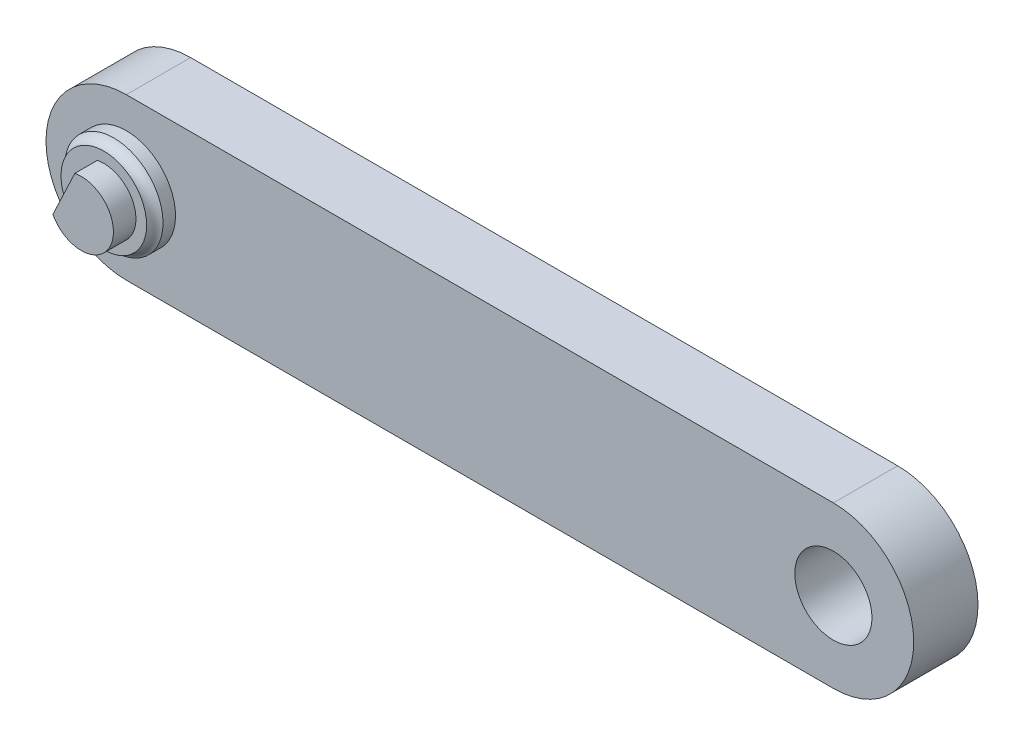
ISO-10303-21;
HEADER;
FILE_DESCRIPTION(('STEP AP214'),'2;1');
FILE_NAME('part.step','',(''),(''),'','','');
FILE_SCHEMA(('AUTOMOTIVE_DESIGN { 1 0 10303 214 1 1 1 1 }'));
ENDSEC;
DATA;
#1=APPLICATION_CONTEXT('core data for automotive mechanical design processes');
#2=APPLICATION_PROTOCOL_DEFINITION('international standard','automotive_design',2000,#1);
#3=PRODUCT_CONTEXT('',#1,'mechanical');
#4=PRODUCT('Part','Part','',(#3));
#5=PRODUCT_RELATED_PRODUCT_CATEGORY('part','',(#4));
#6=PRODUCT_DEFINITION_FORMATION('','',#4);
#7=PRODUCT_DEFINITION_CONTEXT('part definition',#1,'design');
#8=PRODUCT_DEFINITION('design','',#6,#7);
#9=PRODUCT_DEFINITION_SHAPE('','',#8);
#10=(LENGTH_UNIT() NAMED_UNIT(*) SI_UNIT(.MILLI.,.METRE.));
#11=(NAMED_UNIT(*) PLANE_ANGLE_UNIT() SI_UNIT($,.RADIAN.));
#12=(NAMED_UNIT(*) SI_UNIT($,.STERADIAN.) SOLID_ANGLE_UNIT());
#13=UNCERTAINTY_MEASURE_WITH_UNIT(LENGTH_MEASURE(1.E-05),#10,'distance_accuracy_value','');
#14=(GEOMETRIC_REPRESENTATION_CONTEXT(3) GLOBAL_UNCERTAINTY_ASSIGNED_CONTEXT((#13)) GLOBAL_UNIT_ASSIGNED_CONTEXT((#10,
#11,#12)) REPRESENTATION_CONTEXT('',''));
#15=CARTESIAN_POINT('',(0.,0.,0.));
#16=DIRECTION('',(0.,0.,1.));
#17=DIRECTION('',(1.,0.,0.));
#18=AXIS2_PLACEMENT_3D('',#15,#16,#17);
#19=CARTESIAN_POINT('',(-18.7976088830021,-15.2994505494506,0.0107761984166474));
#20=DIRECTION('',(0.,0.,-1.));
#21=DIRECTION('',(-1.,0.,0.));
#22=AXIS2_PLACEMENT_3D('',#19,#20,#21);
#23=PLANE('',#22);
#24=CARTESIAN_POINT('',(0.,0.,0.0107761984166474));
#25=DIRECTION('',(0.,0.,1.));
#26=DIRECTION('',(1.,0.,0.));
#27=AXIS2_PLACEMENT_3D('',#24,#25,#26);
#28=CIRCLE('',#27,13.3173639972004);
#29=CARTESIAN_POINT('',(13.3173639972004,0.,0.0107761984166474));
#30=VERTEX_POINT('',#29);
#31=EDGE_CURVE('E43',#30,#30,#28,.F.);
#32=ORIENTED_EDGE('',*,*,#31,.F.);
#33=EDGE_LOOP('',(#32));
#34=FACE_BOUND('',#33,.T.);
#35=CARTESIAN_POINT('',(0.,0.,0.0107761984166474));
#36=DIRECTION('',(0.,0.,1.));
#37=DIRECTION('',(1.,0.,0.));
#38=AXIS2_PLACEMENT_3D('',#35,#36,#37);
#39=CIRCLE('',#38,10.);
#40=CARTESIAN_POINT('',(-8.83901648481329,-4.67672829884301,0.0107761984166474));
#41=VERTEX_POINT('',#40);
#42=CARTESIAN_POINT('',(-2.01473455114157,9.7949397490968,0.0107761984166474));
#43=VERTEX_POINT('',#42);
#44=EDGE_CURVE('E64',#41,#43,#39,.T.);
#45=ORIENTED_EDGE('',*,*,#44,.F.);
#46=DIRECTION('',(-0.426517620854483,-0.904479252996238,0.));
#47=VECTOR('',#46,1.);
#48=CARTESIAN_POINT('',(-2.01473455114157,9.7949397490968,0.0107761984166474));
#49=LINE('',#48,#47);
#50=EDGE_CURVE('E49',#43,#41,#49,.T.);
#51=ORIENTED_EDGE('',*,*,#50,.F.);
#52=EDGE_LOOP('',(#45,#51));
#53=FACE_BOUND('',#52,.T.);
#54=ADVANCED_FACE('F35',(#34,#53),#23,.F.);
#55=CARTESIAN_POINT('',(0.,0.,0.));
#56=DIRECTION('',(0.,0.,1.));
#57=DIRECTION('',(1.,0.,0.));
#58=AXIS2_PLACEMENT_3D('',#55,#56,#57);
#59=TOROIDAL_SURFACE('',#58,16.75,3.43265291781274);
#60=ORIENTED_EDGE('',*,*,#31,.T.);
#61=EDGE_LOOP('',(#60));
#62=FACE_BOUND('',#61,.T.);
#63=CARTESIAN_POINT('',(0.,0.,-3.11111111111112));
#64=DIRECTION('',(0.,0.,1.));
#65=DIRECTION('',(1.,0.,0.));
#66=AXIS2_PLACEMENT_3D('',#63,#64,#65);
#67=CIRCLE('',#66,15.2994505494505);
#68=CARTESIAN_POINT('',(15.2994505494505,0.,-3.11111111111112));
#69=VERTEX_POINT('',#68);
#70=EDGE_CURVE('E11',#69,#69,#67,.T.);
#71=ORIENTED_EDGE('',*,*,#70,.T.);
#72=EDGE_LOOP('',(#71));
#73=FACE_BOUND('',#72,.T.);
#74=ADVANCED_FACE('F37',(#62,#73),#59,.F.);
#75=CARTESIAN_POINT('',(0.,0.,7.));
#76=DIRECTION('',(0.,0.,1.));
#77=DIRECTION('',(1.,0.,0.));
#78=AXIS2_PLACEMENT_3D('',#75,#76,#77);
#79=CYLINDRICAL_SURFACE('',#78,15.2994505494506);
#80=ORIENTED_EDGE('',*,*,#70,.F.);
#81=EDGE_LOOP('',(#80));
#82=FACE_BOUND('',#81,.T.);
#83=CARTESIAN_POINT('',(0.,0.,-7.));
#84=DIRECTION('',(0.,0.,1.));
#85=DIRECTION('',(1.,0.,0.));
#86=AXIS2_PLACEMENT_3D('',#83,#84,#85);
#87=CIRCLE('',#86,15.2994505494506);
#88=CARTESIAN_POINT('',(15.2994505494506,0.,-7.));
#89=VERTEX_POINT('',#88);
#90=EDGE_CURVE('E122',#89,#89,#87,.T.);
#91=ORIENTED_EDGE('',*,*,#90,.T.);
#92=EDGE_LOOP('',(#91));
#93=FACE_BOUND('',#92,.T.);
#94=ADVANCED_FACE('F150',(#82,#93),#79,.T.);
#95=CARTESIAN_POINT('',(0.,0.,7.02155239841665));
#96=DIRECTION('',(0.,0.,-1.));
#97=DIRECTION('',(-1.,0.,0.));
#98=AXIS2_PLACEMENT_3D('',#95,#96,#97);
#99=CYLINDRICAL_SURFACE('',#98,10.);
#100=ORIENTED_EDGE('',*,*,#44,.T.);
#101=DIRECTION('',(0.,0.,-1.));
#102=VECTOR('',#101,1.);
#103=CARTESIAN_POINT('',(-2.01473455114157,9.7949397490968,7.02155239841665));
#104=LINE('',#103,#102);
#105=CARTESIAN_POINT('',(-2.01473455114157,9.7949397490968,7.02155239841665));
#106=VERTEX_POINT('',#105);
#107=EDGE_CURVE('E139',#106,#43,#104,.T.);
#108=ORIENTED_EDGE('',*,*,#107,.F.);
#109=CARTESIAN_POINT('',(0.,0.,7.02155239841665));
#110=DIRECTION('',(0.,0.,1.));
#111=DIRECTION('',(1.,0.,0.));
#112=AXIS2_PLACEMENT_3D('',#109,#110,#111);
#113=CIRCLE('',#112,10.);
#114=CARTESIAN_POINT('',(-8.83901648481329,-4.67672829884301,7.02155239841665));
#115=VERTEX_POINT('',#114);
#116=EDGE_CURVE('E131',#115,#106,#113,.T.);
#117=ORIENTED_EDGE('',*,*,#116,.F.);
#118=DIRECTION('',(0.,0.,-1.));
#119=VECTOR('',#118,1.);
#120=CARTESIAN_POINT('',(-8.83901648481329,-4.67672829884301,7.02155239841665));
#121=LINE('',#120,#119);
#122=EDGE_CURVE('E134',#115,#41,#121,.T.);
#123=ORIENTED_EDGE('',*,*,#122,.T.);
#124=EDGE_LOOP('',(#100,#108,#117,#123));
#125=FACE_BOUND('',#124,.T.);
#126=ADVANCED_FACE('F152',(#125),#99,.T.);
#127=CARTESIAN_POINT('',(-2.01473455114157,9.7949397490968,7.02155239841665));
#128=DIRECTION('',(0.904479252996238,-0.426517620854483,0.));
#129=DIRECTION('',(0.426517620854483,0.904479252996238,0.));
#130=AXIS2_PLACEMENT_3D('',#127,#128,#129);
#131=PLANE('',#130);
#132=ORIENTED_EDGE('',*,*,#50,.T.);
#133=ORIENTED_EDGE('',*,*,#122,.F.);
#134=DIRECTION('',(-0.426517620854483,-0.904479252996238,0.));
#135=VECTOR('',#134,1.);
#136=CARTESIAN_POINT('',(-2.01473455114157,9.7949397490968,7.02155239841665));
#137=LINE('',#136,#135);
#138=EDGE_CURVE('E57',#106,#115,#137,.T.);
#139=ORIENTED_EDGE('',*,*,#138,.F.);
#140=ORIENTED_EDGE('',*,*,#107,.T.);
#141=EDGE_LOOP('',(#132,#133,#139,#140));
#142=FACE_BOUND('',#141,.T.);
#143=ADVANCED_FACE('F159',(#142),#131,.F.);
#144=CARTESIAN_POINT('',(0.,0.,7.02155239841665));
#145=DIRECTION('',(0.,0.,1.));
#146=DIRECTION('',(1.,0.,0.));
#147=AXIS2_PLACEMENT_3D('',#144,#145,#146);
#148=PLANE('',#147);
#149=ORIENTED_EDGE('',*,*,#116,.T.);
#150=ORIENTED_EDGE('',*,*,#138,.T.);
#151=EDGE_LOOP('',(#149,#150));
#152=FACE_BOUND('',#151,.T.);
#153=ADVANCED_FACE('F167',(#152),#148,.T.);
#154=CARTESIAN_POINT('',(0.,0.,-7.));
#155=DIRECTION('',(0.,0.,1.));
#156=DIRECTION('',(1.,0.,0.));
#157=AXIS2_PLACEMENT_3D('',#154,#155,#156);
#158=PLANE('',#157);
#159=CARTESIAN_POINT('',(220.,0.,-7.));
#160=DIRECTION('',(0.,0.,1.));
#161=DIRECTION('',(1.,0.,0.));
#162=AXIS2_PLACEMENT_3D('',#159,#160,#161);
#163=CIRCLE('',#162,12.);
#164=CARTESIAN_POINT('',(232.,0.,-7.));
#165=VERTEX_POINT('',#164);
#166=EDGE_CURVE('E119',#165,#165,#163,.T.);
#167=ORIENTED_EDGE('',*,*,#166,.F.);
#168=EDGE_LOOP('',(#167));
#169=FACE_BOUND('',#168,.T.);
#170=CARTESIAN_POINT('',(0.,0.,-7.));
#171=DIRECTION('',(0.,0.,1.));
#172=DIRECTION('',(1.,0.,0.));
#173=AXIS2_PLACEMENT_3D('',#170,#171,#172);
#174=CIRCLE('',#173,25.);
#175=CARTESIAN_POINT('',(0.,25.,-7.));
#176=VERTEX_POINT('',#175);
#177=CARTESIAN_POINT('',(0.,-25.,-7.));
#178=VERTEX_POINT('',#177);
#179=EDGE_CURVE('E265',#176,#178,#174,.T.);
#180=ORIENTED_EDGE('',*,*,#179,.T.);
#181=DIRECTION('',(1.,0.,0.));
#182=VECTOR('',#181,1.);
#183=CARTESIAN_POINT('',(0.,-25.,-7.));
#184=LINE('',#183,#182);
#185=CARTESIAN_POINT('',(220.,-25.,-7.));
#186=VERTEX_POINT('',#185);
#187=EDGE_CURVE('E96',#178,#186,#184,.T.);
#188=ORIENTED_EDGE('',*,*,#187,.T.);
#189=CARTESIAN_POINT('',(220.,0.,-7.));
#190=DIRECTION('',(0.,0.,1.));
#191=DIRECTION('',(1.,0.,0.));
#192=AXIS2_PLACEMENT_3D('',#189,#190,#191);
#193=CIRCLE('',#192,25.);
#194=CARTESIAN_POINT('',(220.,25.,-7.));
#195=VERTEX_POINT('',#194);
#196=EDGE_CURVE('E269',#186,#195,#193,.T.);
#197=ORIENTED_EDGE('',*,*,#196,.T.);
#198=DIRECTION('',(-1.,0.,0.));
#199=VECTOR('',#198,1.);
#200=CARTESIAN_POINT('',(0.,25.,-7.));
#201=LINE('',#200,#199);
#202=EDGE_CURVE('E72',#195,#176,#201,.T.);
#203=ORIENTED_EDGE('',*,*,#202,.T.);
#204=EDGE_LOOP('',(#180,#188,#197,#203));
#205=FACE_BOUND('',#204,.T.);
#206=ORIENTED_EDGE('',*,*,#90,.F.);
#207=EDGE_LOOP('',(#206));
#208=FACE_BOUND('',#207,.T.);
#209=ADVANCED_FACE('F165',(#169,#205,#208),#158,.T.);
#210=CARTESIAN_POINT('',(0.,0.,-7.));
#211=DIRECTION('',(0.,0.,-1.));
#212=DIRECTION('',(-1.,0.,0.));
#213=AXIS2_PLACEMENT_3D('',#210,#211,#212);
#214=CYLINDRICAL_SURFACE('',#213,25.);
#215=DIRECTION('',(0.,0.,-1.));
#216=VECTOR('',#215,1.);
#217=CARTESIAN_POINT('',(0.,25.,-7.));
#218=LINE('',#217,#216);
#219=CARTESIAN_POINT('',(0.,25.,-27.));
#220=VERTEX_POINT('',#219);
#221=EDGE_CURVE('E110',#176,#220,#218,.T.);
#222=ORIENTED_EDGE('',*,*,#221,.T.);
#223=CARTESIAN_POINT('',(0.,0.,-27.));
#224=DIRECTION('',(0.,0.,1.));
#225=DIRECTION('',(1.,0.,0.));
#226=AXIS2_PLACEMENT_3D('',#223,#224,#225);
#227=CIRCLE('',#226,25.);
#228=CARTESIAN_POINT('',(0.,-25.,-27.));
#229=VERTEX_POINT('',#228);
#230=EDGE_CURVE('E105',#229,#220,#227,.F.);
#231=ORIENTED_EDGE('',*,*,#230,.F.);
#232=DIRECTION('',(0.,0.,-1.));
#233=VECTOR('',#232,1.);
#234=CARTESIAN_POINT('',(0.,-25.,-7.));
#235=LINE('',#234,#233);
#236=EDGE_CURVE('E109',#178,#229,#235,.T.);
#237=ORIENTED_EDGE('',*,*,#236,.F.);
#238=ORIENTED_EDGE('',*,*,#179,.F.);
#239=EDGE_LOOP('',(#222,#231,#237,#238));
#240=FACE_BOUND('',#239,.T.);
#241=ADVANCED_FACE('F107',(#240),#214,.T.);
#242=CARTESIAN_POINT('',(0.,-25.,-7.));
#243=DIRECTION('',(0.,1.,0.));
#244=DIRECTION('',(0.,0.,1.));
#245=AXIS2_PLACEMENT_3D('',#242,#243,#244);
#246=PLANE('',#245);
#247=DIRECTION('',(1.,0.,0.));
#248=VECTOR('',#247,1.);
#249=CARTESIAN_POINT('',(0.,-25.,-27.));
#250=LINE('',#249,#248);
#251=CARTESIAN_POINT('',(220.,-25.,-27.));
#252=VERTEX_POINT('',#251);
#253=EDGE_CURVE('E116',#229,#252,#250,.T.);
#254=ORIENTED_EDGE('',*,*,#253,.T.);
#255=DIRECTION('',(0.,0.,-1.));
#256=VECTOR('',#255,1.);
#257=CARTESIAN_POINT('',(220.,-25.,-7.));
#258=LINE('',#257,#256);
#259=EDGE_CURVE('E123',#186,#252,#258,.T.);
#260=ORIENTED_EDGE('',*,*,#259,.F.);
#261=ORIENTED_EDGE('',*,*,#187,.F.);
#262=ORIENTED_EDGE('',*,*,#236,.T.);
#263=EDGE_LOOP('',(#254,#260,#261,#262));
#264=FACE_BOUND('',#263,.T.);
#265=ADVANCED_FACE('F121',(#264),#246,.F.);
#266=CARTESIAN_POINT('',(220.,0.,-7.));
#267=DIRECTION('',(0.,0.,-1.));
#268=DIRECTION('',(-1.,0.,0.));
#269=AXIS2_PLACEMENT_3D('',#266,#267,#268);
#270=CYLINDRICAL_SURFACE('',#269,25.);
#271=CARTESIAN_POINT('',(220.,0.,-27.));
#272=DIRECTION('',(0.,0.,1.));
#273=DIRECTION('',(1.,0.,0.));
#274=AXIS2_PLACEMENT_3D('',#271,#272,#273);
#275=CIRCLE('',#274,25.);
#276=CARTESIAN_POINT('',(220.,25.,-27.));
#277=VERTEX_POINT('',#276);
#278=EDGE_CURVE('E88',#252,#277,#275,.T.);
#279=ORIENTED_EDGE('',*,*,#278,.T.);
#280=DIRECTION('',(0.,0.,-1.));
#281=VECTOR('',#280,1.);
#282=CARTESIAN_POINT('',(220.,25.,-7.));
#283=LINE('',#282,#281);
#284=EDGE_CURVE('E127',#195,#277,#283,.T.);
#285=ORIENTED_EDGE('',*,*,#284,.F.);
#286=ORIENTED_EDGE('',*,*,#196,.F.);
#287=ORIENTED_EDGE('',*,*,#259,.T.);
#288=EDGE_LOOP('',(#279,#285,#286,#287));
#289=FACE_BOUND('',#288,.T.);
#290=ADVANCED_FACE('F183',(#289),#270,.T.);
#291=CARTESIAN_POINT('',(0.,25.,-7.));
#292=DIRECTION('',(0.,-1.,0.));
#293=DIRECTION('',(0.,0.,-1.));
#294=AXIS2_PLACEMENT_3D('',#291,#292,#293);
#295=PLANE('',#294);
#296=DIRECTION('',(-1.,0.,0.));
#297=VECTOR('',#296,1.);
#298=CARTESIAN_POINT('',(0.,25.,-27.));
#299=LINE('',#298,#297);
#300=EDGE_CURVE('E267',#277,#220,#299,.T.);
#301=ORIENTED_EDGE('',*,*,#300,.T.);
#302=ORIENTED_EDGE('',*,*,#221,.F.);
#303=ORIENTED_EDGE('',*,*,#202,.F.);
#304=ORIENTED_EDGE('',*,*,#284,.T.);
#305=EDGE_LOOP('',(#301,#302,#303,#304));
#306=FACE_BOUND('',#305,.T.);
#307=ADVANCED_FACE('F180',(#306),#295,.F.);
#308=CARTESIAN_POINT('',(220.,0.,-7.));
#309=DIRECTION('',(0.,0.,-1.));
#310=DIRECTION('',(-1.,0.,0.));
#311=AXIS2_PLACEMENT_3D('',#308,#309,#310);
#312=CYLINDRICAL_SURFACE('',#311,12.);
#313=ORIENTED_EDGE('',*,*,#166,.T.);
#314=EDGE_LOOP('',(#313));
#315=FACE_BOUND('',#314,.T.);
#316=CARTESIAN_POINT('',(220.,0.,-27.));
#317=DIRECTION('',(0.,0.,1.));
#318=DIRECTION('',(1.,0.,0.));
#319=AXIS2_PLACEMENT_3D('',#316,#317,#318);
#320=CIRCLE('',#319,12.);
#321=CARTESIAN_POINT('',(232.,0.,-27.));
#322=VERTEX_POINT('',#321);
#323=EDGE_CURVE('E114',#322,#322,#320,.T.);
#324=ORIENTED_EDGE('',*,*,#323,.F.);
#325=EDGE_LOOP('',(#324));
#326=FACE_BOUND('',#325,.T.);
#327=ADVANCED_FACE('F179',(#315,#326),#312,.F.);
#328=CARTESIAN_POINT('',(0.,0.,-27.));
#329=DIRECTION('',(0.,0.,-1.));
#330=DIRECTION('',(-1.,0.,0.));
#331=AXIS2_PLACEMENT_3D('',#328,#329,#330);
#332=PLANE('',#331);
#333=ORIENTED_EDGE('',*,*,#253,.F.);
#334=ORIENTED_EDGE('',*,*,#230,.T.);
#335=ORIENTED_EDGE('',*,*,#300,.F.);
#336=ORIENTED_EDGE('',*,*,#278,.F.);
#337=EDGE_LOOP('',(#333,#334,#335,#336));
#338=FACE_BOUND('',#337,.T.);
#339=ORIENTED_EDGE('',*,*,#323,.T.);
#340=EDGE_LOOP('',(#339));
#341=FACE_BOUND('',#340,.T.);
#342=ADVANCED_FACE('F117',(#338,#341),#332,.T.);
#343=CLOSED_SHELL('',(#54,#74,#94,#126,#143,#153,#209,#241,#265,#290,#307,#327,#342));
#344=MANIFOLD_SOLID_BREP('B2',#343);
#345=ADVANCED_BREP_SHAPE_REPRESENTATION('',(#18,#344),#14);
#346=SHAPE_DEFINITION_REPRESENTATION(#9,#345);
ENDSEC;
END-ISO-10303-21;
